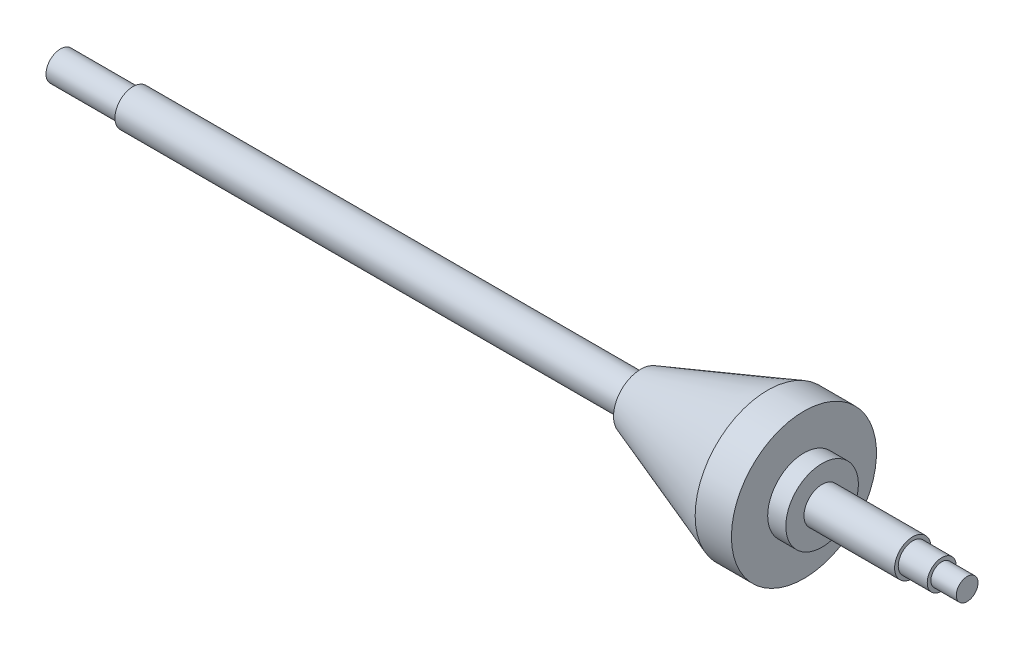
ISO-10303-21;
HEADER;
FILE_DESCRIPTION(('STEP AP214'),'2;1');
FILE_NAME('part.step','',(''),(''),'','','');
FILE_SCHEMA(('AUTOMOTIVE_DESIGN { 1 0 10303 214 1 1 1 1 }'));
ENDSEC;
DATA;
#1=APPLICATION_CONTEXT('core data for automotive mechanical design processes');
#2=APPLICATION_PROTOCOL_DEFINITION('international standard','automotive_design',2000,#1);
#3=PRODUCT_CONTEXT('',#1,'mechanical');
#4=PRODUCT('Part','Part','',(#3));
#5=PRODUCT_RELATED_PRODUCT_CATEGORY('part','',(#4));
#6=PRODUCT_DEFINITION_FORMATION('','',#4);
#7=PRODUCT_DEFINITION_CONTEXT('part definition',#1,'design');
#8=PRODUCT_DEFINITION('design','',#6,#7);
#9=PRODUCT_DEFINITION_SHAPE('','',#8);
#10=(LENGTH_UNIT() NAMED_UNIT(*) SI_UNIT(.MILLI.,.METRE.));
#11=(NAMED_UNIT(*) PLANE_ANGLE_UNIT() SI_UNIT($,.RADIAN.));
#12=(NAMED_UNIT(*) SI_UNIT($,.STERADIAN.) SOLID_ANGLE_UNIT());
#13=UNCERTAINTY_MEASURE_WITH_UNIT(LENGTH_MEASURE(1.E-05),#10,'distance_accuracy_value','');
#14=(GEOMETRIC_REPRESENTATION_CONTEXT(3) GLOBAL_UNCERTAINTY_ASSIGNED_CONTEXT((#13)) GLOBAL_UNIT_ASSIGNED_CONTEXT((#10,
#11,#12)) REPRESENTATION_CONTEXT('',''));
#15=CARTESIAN_POINT('',(0.,0.,0.));
#16=DIRECTION('',(0.,0.,1.));
#17=DIRECTION('',(1.,0.,0.));
#18=AXIS2_PLACEMENT_3D('',#15,#16,#17);
#19=CARTESIAN_POINT('',(-36.2023285562518,0.,0.));
#20=DIRECTION('',(1.,0.,0.));
#21=DIRECTION('',(0.,0.,-1.));
#22=AXIS2_PLACEMENT_3D('',#19,#20,#21);
#23=PLANE('',#22);
#24=CARTESIAN_POINT('',(-36.2023285562518,0.,0.));
#25=DIRECTION('',(-1.,0.,0.));
#26=DIRECTION('',(0.,0.,1.));
#27=AXIS2_PLACEMENT_3D('',#24,#25,#26);
#28=CIRCLE('',#27,4.);
#29=CARTESIAN_POINT('',(-36.2023285562518,0.,4.));
#30=VERTEX_POINT('',#29);
#31=EDGE_CURVE('E10',#30,#30,#28,.T.);
#32=ORIENTED_EDGE('',*,*,#31,.T.);
#33=EDGE_LOOP('',(#32));
#34=FACE_BOUND('',#33,.T.);
#35=ADVANCED_FACE('F31',(#34),#23,.F.);
#36=CARTESIAN_POINT('',(-96.3911200836716,0.,0.));
#37=DIRECTION('',(-1.,0.,0.));
#38=DIRECTION('',(0.,0.,1.));
#39=AXIS2_PLACEMENT_3D('',#36,#37,#38);
#40=CYLINDRICAL_SURFACE('',#39,4.);
#41=ORIENTED_EDGE('',*,*,#31,.F.);
#42=EDGE_LOOP('',(#41));
#43=FACE_BOUND('',#42,.T.);
#44=CARTESIAN_POINT('',(-16.2023285562518,0.,0.));
#45=DIRECTION('',(-1.,0.,0.));
#46=DIRECTION('',(0.,0.,1.));
#47=AXIS2_PLACEMENT_3D('',#44,#45,#46);
#48=CIRCLE('',#47,4.);
#49=CARTESIAN_POINT('',(-16.2023285562518,0.,4.));
#50=VERTEX_POINT('',#49);
#51=EDGE_CURVE('E37',#50,#50,#48,.T.);
#52=ORIENTED_EDGE('',*,*,#51,.T.);
#53=EDGE_LOOP('',(#52));
#54=FACE_BOUND('',#53,.T.);
#55=ADVANCED_FACE('F96',(#43,#54),#40,.T.);
#56=CARTESIAN_POINT('',(-16.2023285562518,4.,0.));
#57=DIRECTION('',(1.,0.,0.));
#58=DIRECTION('',(0.,0.,-1.));
#59=AXIS2_PLACEMENT_3D('',#56,#57,#58);
#60=PLANE('',#59);
#61=ORIENTED_EDGE('',*,*,#51,.F.);
#62=EDGE_LOOP('',(#61));
#63=FACE_BOUND('',#62,.T.);
#64=CARTESIAN_POINT('',(-16.2023285562518,0.,0.));
#65=DIRECTION('',(-1.,0.,0.));
#66=DIRECTION('',(0.,0.,1.));
#67=AXIS2_PLACEMENT_3D('',#64,#65,#66);
#68=CIRCLE('',#67,5.);
#69=CARTESIAN_POINT('',(-16.2023285562518,0.,5.));
#70=VERTEX_POINT('',#69);
#71=EDGE_CURVE('E41',#70,#70,#68,.T.);
#72=ORIENTED_EDGE('',*,*,#71,.T.);
#73=EDGE_LOOP('',(#72));
#74=FACE_BOUND('',#73,.T.);
#75=ADVANCED_FACE('F100',(#63,#74),#60,.F.);
#76=CARTESIAN_POINT('',(-96.3911200836716,0.,0.));
#77=DIRECTION('',(-1.,0.,0.));
#78=DIRECTION('',(0.,0.,1.));
#79=AXIS2_PLACEMENT_3D('',#76,#77,#78);
#80=CYLINDRICAL_SURFACE('',#79,5.00000000000001);
#81=ORIENTED_EDGE('',*,*,#71,.F.);
#82=EDGE_LOOP('',(#81));
#83=FACE_BOUND('',#82,.T.);
#84=CARTESIAN_POINT('',(123.797671443748,0.,0.));
#85=DIRECTION('',(-1.,0.,0.));
#86=DIRECTION('',(0.,0.,1.));
#87=AXIS2_PLACEMENT_3D('',#84,#85,#86);
#88=CIRCLE('',#87,5.);
#89=CARTESIAN_POINT('',(123.797671443748,0.,5.));
#90=VERTEX_POINT('',#89);
#91=EDGE_CURVE('E45',#90,#90,#88,.T.);
#92=ORIENTED_EDGE('',*,*,#91,.T.);
#93=EDGE_LOOP('',(#92));
#94=FACE_BOUND('',#93,.T.);
#95=ADVANCED_FACE('F105',(#83,#94),#80,.T.);
#96=CARTESIAN_POINT('',(123.797671443748,5.,0.));
#97=DIRECTION('',(1.,0.,0.));
#98=DIRECTION('',(0.,0.,-1.));
#99=AXIS2_PLACEMENT_3D('',#96,#97,#98);
#100=PLANE('',#99);
#101=ORIENTED_EDGE('',*,*,#91,.F.);
#102=EDGE_LOOP('',(#101));
#103=FACE_BOUND('',#102,.T.);
#104=CARTESIAN_POINT('',(123.797671443748,0.,0.));
#105=DIRECTION('',(-1.,0.,0.));
#106=DIRECTION('',(0.,0.,1.));
#107=AXIS2_PLACEMENT_3D('',#104,#105,#106);
#108=CIRCLE('',#107,7.5);
#109=CARTESIAN_POINT('',(123.797671443748,0.,7.5));
#110=VERTEX_POINT('',#109);
#111=EDGE_CURVE('E50',#110,#110,#108,.T.);
#112=ORIENTED_EDGE('',*,*,#111,.T.);
#113=EDGE_LOOP('',(#112));
#114=FACE_BOUND('',#113,.T.);
#115=ADVANCED_FACE('F111',(#103,#114),#100,.F.);
#116=CARTESIAN_POINT('',(158.797671443748,0.,0.));
#117=DIRECTION('',(1.,0.,0.));
#118=DIRECTION('',(0.,0.,-1.));
#119=AXIS2_PLACEMENT_3D('',#116,#117,#118);
#120=CONICAL_SURFACE('',#119,20.,0.343023940420704);
#121=ORIENTED_EDGE('',*,*,#111,.F.);
#122=EDGE_LOOP('',(#121));
#123=FACE_BOUND('',#122,.T.);
#124=CARTESIAN_POINT('',(158.797671443748,0.,0.));
#125=DIRECTION('',(-1.,0.,0.));
#126=DIRECTION('',(0.,0.,1.));
#127=AXIS2_PLACEMENT_3D('',#124,#125,#126);
#128=CIRCLE('',#127,20.);
#129=CARTESIAN_POINT('',(158.797671443748,0.,20.));
#130=VERTEX_POINT('',#129);
#131=EDGE_CURVE('E53',#130,#130,#128,.T.);
#132=ORIENTED_EDGE('',*,*,#131,.T.);
#133=EDGE_LOOP('',(#132));
#134=FACE_BOUND('',#133,.T.);
#135=ADVANCED_FACE('F115',(#123,#134),#120,.T.);
#136=CARTESIAN_POINT('',(-96.3911200836716,0.,0.));
#137=DIRECTION('',(-1.,0.,0.));
#138=DIRECTION('',(0.,0.,1.));
#139=AXIS2_PLACEMENT_3D('',#136,#137,#138);
#140=CYLINDRICAL_SURFACE('',#139,20.);
#141=ORIENTED_EDGE('',*,*,#131,.F.);
#142=EDGE_LOOP('',(#141));
#143=FACE_BOUND('',#142,.T.);
#144=CARTESIAN_POINT('',(168.797671443748,0.,0.));
#145=DIRECTION('',(-1.,0.,0.));
#146=DIRECTION('',(0.,0.,1.));
#147=AXIS2_PLACEMENT_3D('',#144,#145,#146);
#148=CIRCLE('',#147,20.);
#149=CARTESIAN_POINT('',(168.797671443748,0.,20.));
#150=VERTEX_POINT('',#149);
#151=EDGE_CURVE('E56',#150,#150,#148,.T.);
#152=ORIENTED_EDGE('',*,*,#151,.T.);
#153=EDGE_LOOP('',(#152));
#154=FACE_BOUND('',#153,.T.);
#155=ADVANCED_FACE('F119',(#143,#154),#140,.T.);
#156=CARTESIAN_POINT('',(168.797671443748,20.,0.));
#157=DIRECTION('',(-1.,0.,0.));
#158=DIRECTION('',(0.,0.,1.));
#159=AXIS2_PLACEMENT_3D('',#156,#157,#158);
#160=PLANE('',#159);
#161=ORIENTED_EDGE('',*,*,#151,.F.);
#162=EDGE_LOOP('',(#161));
#163=FACE_BOUND('',#162,.T.);
#164=CARTESIAN_POINT('',(168.797671443748,0.,0.));
#165=DIRECTION('',(-1.,0.,0.));
#166=DIRECTION('',(0.,0.,1.));
#167=AXIS2_PLACEMENT_3D('',#164,#165,#166);
#168=CIRCLE('',#167,10.);
#169=CARTESIAN_POINT('',(168.797671443748,0.,10.));
#170=VERTEX_POINT('',#169);
#171=EDGE_CURVE('E59',#170,#170,#168,.T.);
#172=ORIENTED_EDGE('',*,*,#171,.T.);
#173=EDGE_LOOP('',(#172));
#174=FACE_BOUND('',#173,.T.);
#175=ADVANCED_FACE('F123',(#163,#174),#160,.F.);
#176=CARTESIAN_POINT('',(-96.3911200836716,0.,0.));
#177=DIRECTION('',(-1.,0.,0.));
#178=DIRECTION('',(0.,0.,1.));
#179=AXIS2_PLACEMENT_3D('',#176,#177,#178);
#180=CYLINDRICAL_SURFACE('',#179,10.);
#181=ORIENTED_EDGE('',*,*,#171,.F.);
#182=EDGE_LOOP('',(#181));
#183=FACE_BOUND('',#182,.T.);
#184=CARTESIAN_POINT('',(173.797671443748,0.,0.));
#185=DIRECTION('',(-1.,0.,0.));
#186=DIRECTION('',(0.,0.,1.));
#187=AXIS2_PLACEMENT_3D('',#184,#185,#186);
#188=CIRCLE('',#187,10.);
#189=CARTESIAN_POINT('',(173.797671443748,0.,10.));
#190=VERTEX_POINT('',#189);
#191=EDGE_CURVE('E62',#190,#190,#188,.T.);
#192=ORIENTED_EDGE('',*,*,#191,.T.);
#193=EDGE_LOOP('',(#192));
#194=FACE_BOUND('',#193,.T.);
#195=ADVANCED_FACE('F127',(#183,#194),#180,.T.);
#196=CARTESIAN_POINT('',(173.797671443748,10.,0.));
#197=DIRECTION('',(-1.,0.,0.));
#198=DIRECTION('',(0.,0.,1.));
#199=AXIS2_PLACEMENT_3D('',#196,#197,#198);
#200=PLANE('',#199);
#201=ORIENTED_EDGE('',*,*,#191,.F.);
#202=EDGE_LOOP('',(#201));
#203=FACE_BOUND('',#202,.T.);
#204=CARTESIAN_POINT('',(173.797671443748,0.,0.));
#205=DIRECTION('',(-1.,0.,0.));
#206=DIRECTION('',(0.,0.,1.));
#207=AXIS2_PLACEMENT_3D('',#204,#205,#206);
#208=CIRCLE('',#207,5.);
#209=CARTESIAN_POINT('',(173.797671443748,0.,5.));
#210=VERTEX_POINT('',#209);
#211=EDGE_CURVE('E65',#210,#210,#208,.T.);
#212=ORIENTED_EDGE('',*,*,#211,.T.);
#213=EDGE_LOOP('',(#212));
#214=FACE_BOUND('',#213,.T.);
#215=ADVANCED_FACE('F131',(#203,#214),#200,.F.);
#216=CARTESIAN_POINT('',(-96.3911200836716,0.,0.));
#217=DIRECTION('',(-1.,0.,0.));
#218=DIRECTION('',(0.,0.,1.));
#219=AXIS2_PLACEMENT_3D('',#216,#217,#218);
#220=CYLINDRICAL_SURFACE('',#219,5.);
#221=ORIENTED_EDGE('',*,*,#211,.F.);
#222=EDGE_LOOP('',(#221));
#223=FACE_BOUND('',#222,.T.);
#224=CARTESIAN_POINT('',(198.797671443748,0.,0.));
#225=DIRECTION('',(-1.,0.,0.));
#226=DIRECTION('',(0.,0.,1.));
#227=AXIS2_PLACEMENT_3D('',#224,#225,#226);
#228=CIRCLE('',#227,5.);
#229=CARTESIAN_POINT('',(198.797671443748,0.,5.));
#230=VERTEX_POINT('',#229);
#231=EDGE_CURVE('E68',#230,#230,#228,.T.);
#232=ORIENTED_EDGE('',*,*,#231,.T.);
#233=EDGE_LOOP('',(#232));
#234=FACE_BOUND('',#233,.T.);
#235=ADVANCED_FACE('F135',(#223,#234),#220,.T.);
#236=CARTESIAN_POINT('',(198.797671443748,5.,0.));
#237=DIRECTION('',(-1.,0.,0.));
#238=DIRECTION('',(0.,0.,1.));
#239=AXIS2_PLACEMENT_3D('',#236,#237,#238);
#240=PLANE('',#239);
#241=ORIENTED_EDGE('',*,*,#231,.F.);
#242=EDGE_LOOP('',(#241));
#243=FACE_BOUND('',#242,.T.);
#244=CARTESIAN_POINT('',(198.797671443748,0.,0.));
#245=DIRECTION('',(-1.,0.,0.));
#246=DIRECTION('',(0.,0.,1.));
#247=AXIS2_PLACEMENT_3D('',#244,#245,#246);
#248=CIRCLE('',#247,4.);
#249=CARTESIAN_POINT('',(198.797671443748,0.,4.));
#250=VERTEX_POINT('',#249);
#251=EDGE_CURVE('E71',#250,#250,#248,.T.);
#252=ORIENTED_EDGE('',*,*,#251,.T.);
#253=EDGE_LOOP('',(#252));
#254=FACE_BOUND('',#253,.T.);
#255=ADVANCED_FACE('F139',(#243,#254),#240,.F.);
#256=CARTESIAN_POINT('',(-96.3911200836716,0.,0.));
#257=DIRECTION('',(-1.,0.,0.));
#258=DIRECTION('',(0.,0.,1.));
#259=AXIS2_PLACEMENT_3D('',#256,#257,#258);
#260=CYLINDRICAL_SURFACE('',#259,4.);
#261=ORIENTED_EDGE('',*,*,#251,.F.);
#262=EDGE_LOOP('',(#261));
#263=FACE_BOUND('',#262,.T.);
#264=CARTESIAN_POINT('',(206.797671443748,0.,0.));
#265=DIRECTION('',(-1.,0.,0.));
#266=DIRECTION('',(0.,0.,1.));
#267=AXIS2_PLACEMENT_3D('',#264,#265,#266);
#268=CIRCLE('',#267,4.);
#269=CARTESIAN_POINT('',(206.797671443748,0.,4.));
#270=VERTEX_POINT('',#269);
#271=EDGE_CURVE('E74',#270,#270,#268,.T.);
#272=ORIENTED_EDGE('',*,*,#271,.T.);
#273=EDGE_LOOP('',(#272));
#274=FACE_BOUND('',#273,.T.);
#275=ADVANCED_FACE('F143',(#263,#274),#260,.T.);
#276=CARTESIAN_POINT('',(206.797671443748,4.,0.));
#277=DIRECTION('',(-1.,0.,0.));
#278=DIRECTION('',(0.,0.,1.));
#279=AXIS2_PLACEMENT_3D('',#276,#277,#278);
#280=PLANE('',#279);
#281=ORIENTED_EDGE('',*,*,#271,.F.);
#282=EDGE_LOOP('',(#281));
#283=FACE_BOUND('',#282,.T.);
#284=CARTESIAN_POINT('',(206.797671443748,0.,0.));
#285=DIRECTION('',(-1.,0.,0.));
#286=DIRECTION('',(0.,0.,1.));
#287=AXIS2_PLACEMENT_3D('',#284,#285,#286);
#288=CIRCLE('',#287,3.);
#289=CARTESIAN_POINT('',(206.797671443748,0.,3.));
#290=VERTEX_POINT('',#289);
#291=EDGE_CURVE('E77',#290,#290,#288,.T.);
#292=ORIENTED_EDGE('',*,*,#291,.T.);
#293=EDGE_LOOP('',(#292));
#294=FACE_BOUND('',#293,.T.);
#295=ADVANCED_FACE('F92',(#283,#294),#280,.F.);
#296=CARTESIAN_POINT('',(-96.3911200836716,0.,0.));
#297=DIRECTION('',(-1.,0.,0.));
#298=DIRECTION('',(0.,0.,1.));
#299=AXIS2_PLACEMENT_3D('',#296,#297,#298);
#300=CYLINDRICAL_SURFACE('',#299,3.);
#301=ORIENTED_EDGE('',*,*,#291,.F.);
#302=EDGE_LOOP('',(#301));
#303=FACE_BOUND('',#302,.T.);
#304=CARTESIAN_POINT('',(213.797671443748,0.,0.));
#305=DIRECTION('',(-1.,0.,0.));
#306=DIRECTION('',(0.,0.,1.));
#307=AXIS2_PLACEMENT_3D('',#304,#305,#306);
#308=CIRCLE('',#307,3.);
#309=CARTESIAN_POINT('',(213.797671443748,0.,3.));
#310=VERTEX_POINT('',#309);
#311=EDGE_CURVE('E80',#310,#310,#308,.T.);
#312=ORIENTED_EDGE('',*,*,#311,.T.);
#313=EDGE_LOOP('',(#312));
#314=FACE_BOUND('',#313,.T.);
#315=ADVANCED_FACE('F84',(#303,#314),#300,.T.);
#316=CARTESIAN_POINT('',(213.797671443748,3.,0.));
#317=DIRECTION('',(-1.,0.,0.));
#318=DIRECTION('',(0.,0.,1.));
#319=AXIS2_PLACEMENT_3D('',#316,#317,#318);
#320=PLANE('',#319);
#321=ORIENTED_EDGE('',*,*,#311,.F.);
#322=EDGE_LOOP('',(#321));
#323=FACE_BOUND('',#322,.T.);
#324=ADVANCED_FACE('F86',(#323),#320,.F.);
#325=CLOSED_SHELL('',(#35,#55,#75,#95,#115,#135,#155,#175,#195,#215,#235,#255,#275,#295,#315,#324));
#326=MANIFOLD_SOLID_BREP('B2',#325);
#327=ADVANCED_BREP_SHAPE_REPRESENTATION('',(#18,#326),#14);
#328=SHAPE_DEFINITION_REPRESENTATION(#9,#327);
ENDSEC;
END-ISO-10303-21;
